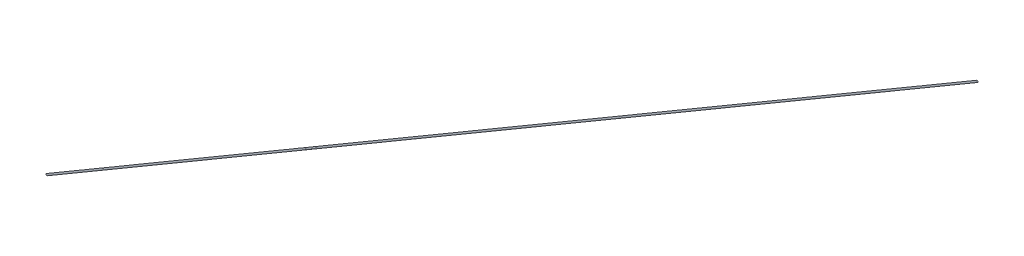
ISO-10303-21;
HEADER;
FILE_DESCRIPTION(('STEP AP214'),'2;1');
FILE_NAME('part.step','',(''),(''),'','','');
FILE_SCHEMA(('AUTOMOTIVE_DESIGN { 1 0 10303 214 1 1 1 1 }'));
ENDSEC;
DATA;
#1=APPLICATION_CONTEXT('core data for automotive mechanical design processes');
#2=APPLICATION_PROTOCOL_DEFINITION('international standard','automotive_design',2000,#1);
#3=PRODUCT_CONTEXT('',#1,'mechanical');
#4=PRODUCT('Part','Part','',(#3));
#5=PRODUCT_RELATED_PRODUCT_CATEGORY('part','',(#4));
#6=PRODUCT_DEFINITION_FORMATION('','',#4);
#7=PRODUCT_DEFINITION_CONTEXT('part definition',#1,'design');
#8=PRODUCT_DEFINITION('design','',#6,#7);
#9=PRODUCT_DEFINITION_SHAPE('','',#8);
#10=(LENGTH_UNIT() NAMED_UNIT(*) SI_UNIT(.MILLI.,.METRE.));
#11=(NAMED_UNIT(*) PLANE_ANGLE_UNIT() SI_UNIT($,.RADIAN.));
#12=(NAMED_UNIT(*) SI_UNIT($,.STERADIAN.) SOLID_ANGLE_UNIT());
#13=UNCERTAINTY_MEASURE_WITH_UNIT(LENGTH_MEASURE(1.E-05),#10,'distance_accuracy_value','');
#14=(GEOMETRIC_REPRESENTATION_CONTEXT(3) GLOBAL_UNCERTAINTY_ASSIGNED_CONTEXT((#13)) GLOBAL_UNIT_ASSIGNED_CONTEXT((#10,
#11,#12)) REPRESENTATION_CONTEXT('',''));
#15=CARTESIAN_POINT('',(0.,0.,0.));
#16=DIRECTION('',(0.,0.,1.));
#17=DIRECTION('',(1.,0.,0.));
#18=AXIS2_PLACEMENT_3D('',#15,#16,#17);
#19=CARTESIAN_POINT('',(60.,0.,0.));
#20=DIRECTION('',(0.,0.,1.));
#21=DIRECTION('',(1.,0.,0.));
#22=AXIS2_PLACEMENT_3D('',#19,#20,#21);
#23=PLANE('',#22);
#24=CARTESIAN_POINT('',(60.,0.,0.));
#25=DIRECTION('',(0.,0.,1.));
#26=DIRECTION('',(1.,0.,0.));
#27=AXIS2_PLACEMENT_3D('',#24,#25,#26);
#28=CIRCLE('',#27,5.);
#29=CARTESIAN_POINT('',(65.,0.,0.));
#30=VERTEX_POINT('',#29);
#31=EDGE_CURVE('E23',#30,#30,#28,.T.);
#32=ORIENTED_EDGE('',*,*,#31,.F.);
#33=EDGE_LOOP('',(#32));
#34=FACE_BOUND('',#33,.T.);
#35=ADVANCED_FACE('F16',(#34),#23,.F.);
#36=CARTESIAN_POINT('',(6297.19704984039,4071.67408557934,995.601907227024));
#37=DIRECTION('',(0.,0.,1.));
#38=DIRECTION('',(1.,0.,0.));
#39=AXIS2_PLACEMENT_3D('',#36,#37,#38);
#40=PLANE('',#39);
#41=CARTESIAN_POINT('',(6297.19704984039,4071.67408557934,995.601907227024));
#42=DIRECTION('',(0.,0.,1.));
#43=DIRECTION('',(1.,0.,0.));
#44=AXIS2_PLACEMENT_3D('',#41,#42,#43);
#45=CIRCLE('',#44,5.);
#46=CARTESIAN_POINT('',(6302.19704984039,4071.67408557934,995.601907227024));
#47=VERTEX_POINT('',#46);
#48=EDGE_CURVE('E10',#47,#47,#45,.T.);
#49=ORIENTED_EDGE('',*,*,#48,.T.);
#50=EDGE_LOOP('',(#49));
#51=FACE_BOUND('',#50,.T.);
#52=ADVANCED_FACE('F30',(#51),#40,.T.);
#53=CARTESIAN_POINT('',(65.,0.,0.));
#54=CARTESIAN_POINT('',(6302.19704984039,4071.67408557934,995.601907227024));
#55=CARTESIAN_POINT('',(65.0000000000001,10.0000000000001,0.));
#56=CARTESIAN_POINT('',(6302.1970498404,4081.67408557933,995.601907227023));
#57=CARTESIAN_POINT('',(54.9999999999999,10.0000000000001,0.));
#58=CARTESIAN_POINT('',(6292.19704984039,4081.67408557933,995.601907227023));
#59=CARTESIAN_POINT('',(55.,0.,0.));
#60=CARTESIAN_POINT('',(6292.19704984039,4071.67408557934,995.601907227024));
#61=CARTESIAN_POINT('',(54.9999999999999,-10.0000000000001,0.));
#62=CARTESIAN_POINT('',(6292.19704984039,4061.67408557933,995.601907227023));
#63=CARTESIAN_POINT('',(65.0000000000001,-10.0000000000001,0.));
#64=CARTESIAN_POINT('',(6302.1970498404,4061.67408557933,995.601907227023));
#65=CARTESIAN_POINT('',(65.,0.,0.));
#66=CARTESIAN_POINT('',(6302.19704984039,4071.67408557934,995.601907227024));
#67=(BOUNDED_SURFACE() B_SPLINE_SURFACE(3,1,((#53,#54),(#55,#56),(#57,#58),(#59,#60),(#61,#62),
(#63,#64),(#65,#66)),.UNSPECIFIED.,.T.,.F.,.F.) B_SPLINE_SURFACE_WITH_KNOTS((4,3,4),(2,2),(0.,
0.5,1.),(0.,1.),.UNSPECIFIED.) GEOMETRIC_REPRESENTATION_ITEM() RATIONAL_B_SPLINE_SURFACE(((1.,
1.),(0.333333333333334,0.333333333333334),(0.333333333333334,0.333333333333334),(1.,1.),
(0.333333333333334,0.333333333333334),(0.333333333333334,0.333333333333334),(1.,1.))) REPRESENTATION_ITEM('') SURFACE());
#68=ORIENTED_EDGE('',*,*,#48,.F.);
#69=EDGE_LOOP('',(#68));
#70=FACE_BOUND('',#69,.T.);
#71=ORIENTED_EDGE('',*,*,#31,.T.);
#72=EDGE_LOOP('',(#71));
#73=FACE_BOUND('',#72,.T.);
#74=ADVANCED_FACE('F32',(#70,#73),#67,.T.);
#75=CLOSED_SHELL('',(#35,#52,#74));
#76=MANIFOLD_SOLID_BREP('B1',#75);
#77=ADVANCED_BREP_SHAPE_REPRESENTATION('',(#18,#76),#14);
#78=SHAPE_DEFINITION_REPRESENTATION(#9,#77);
ENDSEC;
END-ISO-10303-21;
